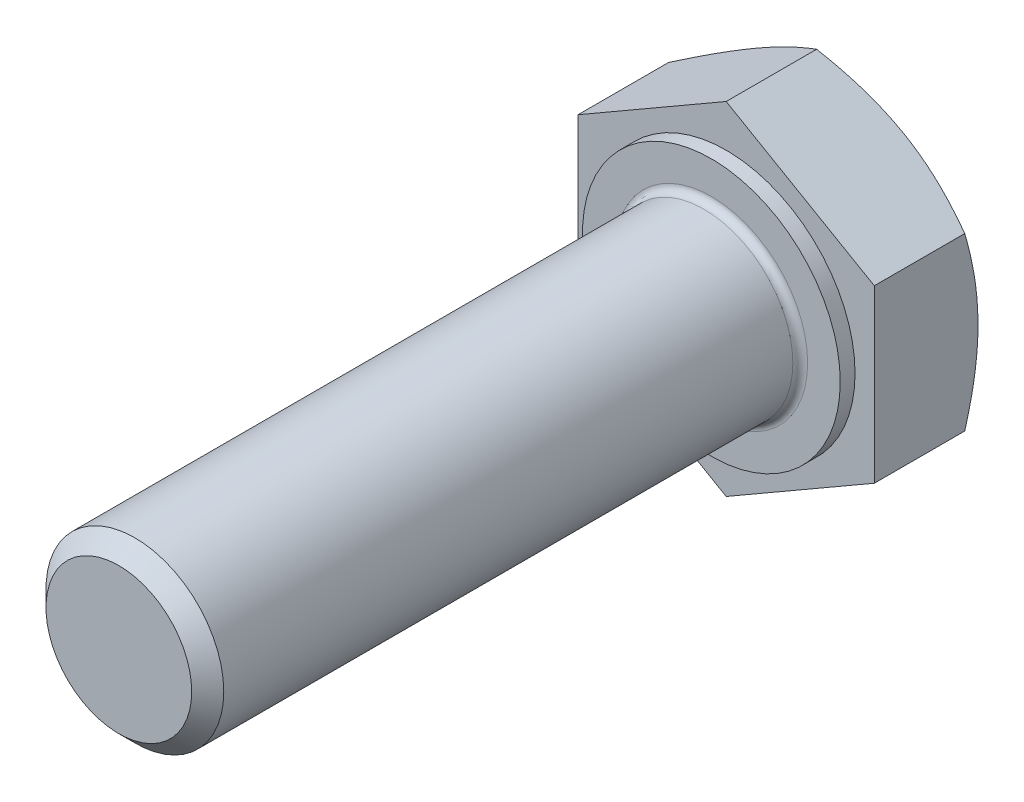
ISO-10303-21;
HEADER;
FILE_DESCRIPTION(('STEP AP214'),'2;1');
FILE_NAME('part.step','',(''),(''),'','','');
FILE_SCHEMA(('AUTOMOTIVE_DESIGN { 1 0 10303 214 1 1 1 1 }'));
ENDSEC;
DATA;
#1=APPLICATION_CONTEXT('core data for automotive mechanical design processes');
#2=APPLICATION_PROTOCOL_DEFINITION('international standard','automotive_design',2000,#1);
#3=PRODUCT_CONTEXT('',#1,'mechanical');
#4=PRODUCT('Part','Part','',(#3));
#5=PRODUCT_RELATED_PRODUCT_CATEGORY('part','',(#4));
#6=PRODUCT_DEFINITION_FORMATION('','',#4);
#7=PRODUCT_DEFINITION_CONTEXT('part definition',#1,'design');
#8=PRODUCT_DEFINITION('design','',#6,#7);
#9=PRODUCT_DEFINITION_SHAPE('','',#8);
#10=(LENGTH_UNIT() NAMED_UNIT(*) SI_UNIT(.MILLI.,.METRE.));
#11=(NAMED_UNIT(*) PLANE_ANGLE_UNIT() SI_UNIT($,.RADIAN.));
#12=(NAMED_UNIT(*) SI_UNIT($,.STERADIAN.) SOLID_ANGLE_UNIT());
#13=UNCERTAINTY_MEASURE_WITH_UNIT(LENGTH_MEASURE(1.E-05),#10,'distance_accuracy_value','');
#14=(GEOMETRIC_REPRESENTATION_CONTEXT(3) GLOBAL_UNCERTAINTY_ASSIGNED_CONTEXT((#13)) GLOBAL_UNIT_ASSIGNED_CONTEXT((#10,
#11,#12)) REPRESENTATION_CONTEXT('',''));
#15=CARTESIAN_POINT('',(0.,0.,0.));
#16=DIRECTION('',(0.,0.,1.));
#17=DIRECTION('',(1.,0.,0.));
#18=AXIS2_PLACEMENT_3D('',#15,#16,#17);
#19=CARTESIAN_POINT('',(0.,0.,-0.5));
#20=DIRECTION('',(0.,0.,1.));
#21=DIRECTION('',(-1.,0.,0.));
#22=AXIS2_PLACEMENT_3D('',#19,#20,#21);
#23=PLANE('',#22);
#24=CARTESIAN_POINT('',(0.,0.,-0.5));
#25=DIRECTION('',(0.,0.,1.));
#26=DIRECTION('',(1.,0.,0.));
#27=AXIS2_PLACEMENT_3D('',#24,#25,#26);
#28=CIRCLE('',#27,4.35);
#29=CARTESIAN_POINT('',(4.35,0.,-0.5));
#30=VERTEX_POINT('',#29);
#31=EDGE_CURVE('E12',#30,#30,#28,.T.);
#32=ORIENTED_EDGE('',*,*,#31,.F.);
#33=EDGE_LOOP('',(#32));
#34=FACE_BOUND('',#33,.T.);
#35=DIRECTION('',(0.866025403784439,-0.5,0.));
#36=VECTOR('',#35,1.);
#37=CARTESIAN_POINT('',(0.,-5.77350269189626,-0.5));
#38=LINE('',#37,#36);
#39=CARTESIAN_POINT('',(-5.,-2.88675134594813,-0.5));
#40=VERTEX_POINT('',#39);
#41=CARTESIAN_POINT('',(0.,-5.77350269189626,-0.5));
#42=VERTEX_POINT('',#41);
#43=EDGE_CURVE('E234',#40,#42,#38,.T.);
#44=ORIENTED_EDGE('',*,*,#43,.T.);
#45=DIRECTION('',(0.866025403784439,0.5,0.));
#46=VECTOR('',#45,1.);
#47=CARTESIAN_POINT('',(5.,-2.88675134594812,-0.5));
#48=LINE('',#47,#46);
#49=CARTESIAN_POINT('',(5.,-2.88675134594812,-0.5));
#50=VERTEX_POINT('',#49);
#51=EDGE_CURVE('E122',#42,#50,#48,.T.);
#52=ORIENTED_EDGE('',*,*,#51,.T.);
#53=DIRECTION('',(0.,1.,0.));
#54=VECTOR('',#53,1.);
#55=CARTESIAN_POINT('',(5.,2.88675134594813,-0.5));
#56=LINE('',#55,#54);
#57=CARTESIAN_POINT('',(5.,2.88675134594813,-0.5));
#58=VERTEX_POINT('',#57);
#59=EDGE_CURVE('E48',#50,#58,#56,.T.);
#60=ORIENTED_EDGE('',*,*,#59,.T.);
#61=DIRECTION('',(-0.866025403784439,0.5,0.));
#62=VECTOR('',#61,1.);
#63=CARTESIAN_POINT('',(0.,5.77350269189626,-0.5));
#64=LINE('',#63,#62);
#65=CARTESIAN_POINT('',(0.,5.77350269189626,-0.5));
#66=VERTEX_POINT('',#65);
#67=EDGE_CURVE('E129',#58,#66,#64,.T.);
#68=ORIENTED_EDGE('',*,*,#67,.T.);
#69=DIRECTION('',(-0.866025403784439,-0.5,0.));
#70=VECTOR('',#69,1.);
#71=CARTESIAN_POINT('',(-5.,2.88675134594813,-0.5));
#72=LINE('',#71,#70);
#73=CARTESIAN_POINT('',(-5.,2.88675134594813,-0.5));
#74=VERTEX_POINT('',#73);
#75=EDGE_CURVE('E245',#66,#74,#72,.T.);
#76=ORIENTED_EDGE('',*,*,#75,.T.);
#77=DIRECTION('',(0.,-1.,0.));
#78=VECTOR('',#77,1.);
#79=CARTESIAN_POINT('',(-5.,-2.88675134594813,-0.5));
#80=LINE('',#79,#78);
#81=EDGE_CURVE('E236',#74,#40,#80,.T.);
#82=ORIENTED_EDGE('',*,*,#81,.T.);
#83=EDGE_LOOP('',(#44,#52,#60,#68,#76,#82));
#84=FACE_BOUND('',#83,.T.);
#85=ADVANCED_FACE('F39',(#34,#84),#23,.T.);
#86=CARTESIAN_POINT('',(0.,0.,-3.55255354137804));
#87=DIRECTION('',(0.,0.,1.));
#88=DIRECTION('',(-1.,0.,0.));
#89=AXIS2_PLACEMENT_3D('',#86,#87,#88);
#90=CONICAL_SURFACE('',#89,5.775,1.0471975511966);
#91=CARTESIAN_POINT('',(0.,0.,-4.));
#92=DIRECTION('',(0.,0.,1.));
#93=DIRECTION('',(-1.,0.,0.));
#94=AXIS2_PLACEMENT_3D('',#91,#92,#93);
#95=CIRCLE('',#94,5.);
#96=CARTESIAN_POINT('',(-2.5,-4.3301270189222,-4.));
#97=VERTEX_POINT('',#96);
#98=CARTESIAN_POINT('',(2.5,-4.33012701892219,-4.));
#99=VERTEX_POINT('',#98);
#100=EDGE_CURVE('E298',#97,#99,#95,.T.);
#101=ORIENTED_EDGE('',*,*,#100,.T.);
#102=CARTESIAN_POINT('',(5.000002,-2.88675019124759,-3.55341734594793));
#103=CARTESIAN_POINT('',(4.78027074694607,-3.01361208934764,-3.62667401283849));
#104=CARTESIAN_POINT('',(4.5586601198803,-3.14155904453935,-3.69330350087609));
#105=CARTESIAN_POINT('',(4.11160176522467,-3.39966830594325,-3.80960388176341));
#106=CARTESIAN_POINT('',(3.88614609670003,-3.52983519685628,-3.859233638035));
#107=CARTESIAN_POINT('',(3.43799439633442,-3.78857570170015,-3.93647343389728));
#108=CARTESIAN_POINT('',(3.21536814331772,-3.91710902880802,-3.96459799992946));
#109=CARTESIAN_POINT('',(2.8806459561398,-4.11036097367893,-3.98981464288414));
#110=CARTESIAN_POINT('',(2.76899557601673,-4.17482235069811,-3.99539321968897));
#111=CARTESIAN_POINT('',(2.54559174139457,-4.30380461475521,-4.00079886451652));
#112=CARTESIAN_POINT('',(2.43383829018766,-4.36832549989239,-4.00062611028573));
#113=CARTESIAN_POINT('',(2.12769088590962,-4.54507978616402,-3.99223835401767));
#114=CARTESIAN_POINT('',(1.93339845483021,-4.65725457354923,-3.97816111429647));
#115=CARTESIAN_POINT('',(1.54610304420474,-4.88085968312974,-3.93352860367383));
#116=CARTESIAN_POINT('',(1.35310142524446,-4.9922892197905,-3.90295808665975));
#117=CARTESIAN_POINT('',(0.965026180739004,-5.21634456667155,-3.826542206783));
#118=CARTESIAN_POINT('',(0.770001514907567,-5.32894210998795,-3.78037315312653));
#119=CARTESIAN_POINT('',(0.382860131316658,-5.55245829201861,-3.67558875648398));
#120=CARTESIAN_POINT('',(0.190738457644299,-5.66337979203051,-3.61699801824105));
#121=CARTESIAN_POINT('',(-1.9999999987924E-06,-5.7735038465968,-3.55341734594793));
#122=B_SPLINE_CURVE_WITH_KNOTS('',3,(#102,#103,#104,#105,#106,#107,#108,#109,#110,#111,#112,
#113,#114,#115,#116,#117,#118,#119,#120,#121),.UNSPECIFIED.,.F.,.F.,(4,2,2,2,2,2,2,2,2,4),(0.,
0.792540187012439,1.58698486313849,2.36176947896395,2.74878786986339,3.13579429986343,
3.80946255620209,4.48375460996337,5.17299926182492,5.86089121185928),.UNSPECIFIED.);
#123=CARTESIAN_POINT('',(0.,-5.77350269189626,-3.5534180126148));
#124=VERTEX_POINT('',#123);
#125=EDGE_CURVE('E55',#99,#124,#122,.T.);
#126=ORIENTED_EDGE('',*,*,#125,.T.);
#127=CARTESIAN_POINT('',(2.00000000060511E-06,-5.7735038465968,-3.55341734594793));
#128=CARTESIAN_POINT('',(-0.219729253053924,-5.64664194849674,-3.62667401283849));
#129=CARTESIAN_POINT('',(-0.441339880119702,-5.51869499330503,-3.69330350087609));
#130=CARTESIAN_POINT('',(-0.888398234775334,-5.26058573190113,-3.80960388176341));
#131=CARTESIAN_POINT('',(-1.11385390329997,-5.13041884098811,-3.85923363803499));
#132=CARTESIAN_POINT('',(-1.56200560366558,-4.87167833614423,-3.93647343389728));
#133=CARTESIAN_POINT('',(-1.78463185668228,-4.74314500903636,-3.96459799992946));
#134=CARTESIAN_POINT('',(-2.1193540438602,-4.54989306416545,-3.98981464288413));
#135=CARTESIAN_POINT('',(-2.23100442398327,-4.48543168714627,-3.99539321968897));
#136=CARTESIAN_POINT('',(-2.45440825860543,-4.35644942308917,-4.00079886451652));
#137=CARTESIAN_POINT('',(-2.56616170981234,-4.291928537952,-4.00062611028572));
#138=CARTESIAN_POINT('',(-2.87230911409038,-4.11517425168036,-3.99223835401768));
#139=CARTESIAN_POINT('',(-3.06660154516979,-4.00299946429516,-3.97816111429647));
#140=CARTESIAN_POINT('',(-3.45389695579525,-3.77939435471464,-3.93352860367382));
#141=CARTESIAN_POINT('',(-3.64689857475554,-3.66796481805389,-3.90295808665975));
#142=CARTESIAN_POINT('',(-4.03497381926099,-3.44390947117283,-3.826542206783));
#143=CARTESIAN_POINT('',(-4.22999848509243,-3.33131192785644,-3.78037315312652));
#144=CARTESIAN_POINT('',(-4.61713986868334,-3.10779574582578,-3.67558875648398));
#145=CARTESIAN_POINT('',(-4.8092615423557,-2.99687424581388,-3.61699801824105));
#146=CARTESIAN_POINT('',(-5.000002,-2.88675019124759,-3.55341734594793));
#147=B_SPLINE_CURVE_WITH_KNOTS('',3,(#127,#128,#129,#130,#131,#132,#133,#134,#135,#136,#137,
#138,#139,#140,#141,#142,#143,#144,#145,#146),.UNSPECIFIED.,.F.,.F.,(4,2,2,2,2,2,2,2,2,4),(0.,
0.792540187012439,1.58698486313849,2.36176947896395,2.74878786986339,3.13579429986343,
3.80946255620209,4.48375460996337,5.17299926182491,5.86089121185927),.UNSPECIFIED.);
#148=EDGE_CURVE('E194',#124,#97,#147,.T.);
#149=ORIENTED_EDGE('',*,*,#148,.T.);
#150=EDGE_LOOP('',(#101,#126,#149));
#151=FACE_BOUND('',#150,.T.);
#152=ADVANCED_FACE('F160',(#151),#90,.T.);
#153=CARTESIAN_POINT('',(5.,0.,-4.));
#154=VERTEX_POINT('',#153);
#155=CARTESIAN_POINT('',(2.5,4.3301270189222,-4.));
#156=VERTEX_POINT('',#155);
#157=EDGE_CURVE('E318',#154,#156,#95,.T.);
#158=ORIENTED_EDGE('',*,*,#157,.T.);
#159=CARTESIAN_POINT('',(-2.00000000180708E-06,5.7735038465968,-3.55341734594793));
#160=CARTESIAN_POINT('',(0.219729253053923,5.64664194849674,-3.62667401283849));
#161=CARTESIAN_POINT('',(0.441339880119701,5.51869499330503,-3.69330350087608));
#162=CARTESIAN_POINT('',(0.888398234775333,5.26058573190113,-3.80960388176341));
#163=CARTESIAN_POINT('',(1.11385390329997,5.13041884098811,-3.85923363803499));
#164=CARTESIAN_POINT('',(1.56200560366558,4.87167833614423,-3.93647343389727));
#165=CARTESIAN_POINT('',(1.78463185668228,4.74314500903636,-3.96459799992946));
#166=CARTESIAN_POINT('',(2.1193540438602,4.54989306416545,-3.98981464288413));
#167=CARTESIAN_POINT('',(2.23100442398327,4.48543168714627,-3.99539321968896));
#168=CARTESIAN_POINT('',(2.45440825860543,4.35644942308917,-4.00079886451652));
#169=CARTESIAN_POINT('',(2.56616170981234,4.291928537952,-4.00062611028572));
#170=CARTESIAN_POINT('',(2.87230911409038,4.11517425168036,-3.99223835401768));
#171=CARTESIAN_POINT('',(3.06660154516979,4.00299946429516,-3.97816111429647));
#172=CARTESIAN_POINT('',(3.45389695579525,3.77939435471464,-3.93352860367382));
#173=CARTESIAN_POINT('',(3.64689857475554,3.66796481805389,-3.90295808665975));
#174=CARTESIAN_POINT('',(4.03497381926099,3.44390947117283,-3.826542206783));
#175=CARTESIAN_POINT('',(4.22999848509243,3.33131192785644,-3.78037315312652));
#176=CARTESIAN_POINT('',(4.61713986868334,3.10779574582578,-3.67558875648398));
#177=CARTESIAN_POINT('',(4.8092615423557,2.99687424581388,-3.61699801824105));
#178=CARTESIAN_POINT('',(5.000002,2.88675019124759,-3.55341734594793));
#179=B_SPLINE_CURVE_WITH_KNOTS('',3,(#159,#160,#161,#162,#163,#164,#165,#166,#167,#168,#169,
#170,#171,#172,#173,#174,#175,#176,#177,#178),.UNSPECIFIED.,.F.,.F.,(4,2,2,2,2,2,2,2,2,4),(0.,
0.792540187012439,1.58698486313849,2.36176947896395,2.74878786986339,3.13579429986343,
3.80946255620209,4.48375460996337,5.17299926182492,5.86089121185927),.UNSPECIFIED.);
#180=CARTESIAN_POINT('',(5.,2.88675134594813,-3.5534180126148));
#181=VERTEX_POINT('',#180);
#182=EDGE_CURVE('E168',#156,#181,#179,.T.);
#183=ORIENTED_EDGE('',*,*,#182,.T.);
#184=CARTESIAN_POINT('',(5.,7.6562098916072,-1.60730851220314));
#185=CARTESIAN_POINT('',(5.,7.43668068445188,-1.71339764971142));
#186=CARTESIAN_POINT('',(5.,7.21663244981121,-1.81843220971194));
#187=CARTESIAN_POINT('',(5.,6.77521729214901,-2.02578955660455));
#188=CARTESIAN_POINT('',(5.,6.55385014884433,-2.12811187401153));
#189=CARTESIAN_POINT('',(5.,6.10832079221155,-2.32998113103873));
#190=CARTESIAN_POINT('',(5.,5.8841498332562,-2.42950883856025));
#191=CARTESIAN_POINT('',(5.,5.43396545890423,-2.62428946678928));
#192=CARTESIAN_POINT('',(5.,5.20795214026935,-2.71954261031161));
#193=CARTESIAN_POINT('',(5.,4.75091730358843,-2.90576853562678));
#194=CARTESIAN_POINT('',(5.,4.51986836696229,-2.99667439468201));
#195=CARTESIAN_POINT('',(5.,4.05504511794165,-3.17136663535019));
#196=CARTESIAN_POINT('',(5.,3.82127050561655,-3.25515222488515));
#197=CARTESIAN_POINT('',(5.,3.3511049214154,-3.41335295122633));
#198=CARTESIAN_POINT('',(5.,3.1147207202618,-3.48778800852407));
#199=CARTESIAN_POINT('',(5.,2.63858935414024,-3.62486947210752));
#200=CARTESIAN_POINT('',(5.,2.39884327849118,-3.6875196062624));
#201=CARTESIAN_POINT('',(5.,1.91583600979795,-3.79799301517174));
#202=CARTESIAN_POINT('',(5.,1.67257390027251,-3.845812348464));
#203=CARTESIAN_POINT('',(5.,1.18308256945893,-3.92339260894802));
#204=CARTESIAN_POINT('',(5.,0.936853345569403,-3.95315352030607));
#205=CARTESIAN_POINT('',(5.,0.567117593289453,-3.98234325133118));
#206=CARTESIAN_POINT('',(5.,0.444189898759257,-3.98949936634909));
#207=CARTESIAN_POINT('',(5.,0.198136128994923,-3.99860265589306));
#208=CARTESIAN_POINT('',(5.,0.0750100563582899,-4.00054989807679));
#209=CARTESIAN_POINT('',(5.,-0.171177216207564,-3.99918313774808));
#210=CARTESIAN_POINT('',(5.,-0.294238424644018,-3.99587061329656));
#211=CARTESIAN_POINT('',(5.,-0.540114422491308,-3.98406827403109));
#212=CARTESIAN_POINT('',(5.,-0.662929199152967,-3.97557819794883));
#213=CARTESIAN_POINT('',(5.,-0.960602635172514,-3.94890221291608));
#214=CARTESIAN_POINT('',(5.,-1.13523252606317,-3.92812146624754));
#215=CARTESIAN_POINT('',(5.,-1.48312982453558,-3.87724859224778));
#216=CARTESIAN_POINT('',(5.,-1.65639704728773,-3.84715522336811));
#217=CARTESIAN_POINT('',(5.,-2.00145990992849,-3.77872143768562));
#218=CARTESIAN_POINT('',(5.,-2.17325390132185,-3.74037278751756));
#219=CARTESIAN_POINT('',(5.,-2.51508012917843,-3.65659803659306));
#220=CARTESIAN_POINT('',(5.,-2.68511247222647,-3.61117236671524));
#221=CARTESIAN_POINT('',(5.,-3.02759472997325,-3.51314465542335));
#222=CARTESIAN_POINT('',(5.,-3.20000183568427,-3.46039407843568));
#223=CARTESIAN_POINT('',(5.,-3.54299370259062,-3.34968060702553));
#224=CARTESIAN_POINT('',(5.,-3.71357963115188,-3.29172130765132));
#225=CARTESIAN_POINT('',(5.,-4.0522446464634,-3.17178761900049));
#226=CARTESIAN_POINT('',(5.00000000000001,-4.22033243885281,-3.10983766516145));
#227=CARTESIAN_POINT('',(5.00000000000001,-4.55520387372807,-2.98230148307792));
#228=CARTESIAN_POINT('',(5.,-4.72198695763951,-2.91671378527652));
#229=CARTESIAN_POINT('',(5.,-4.88816412582648,-2.84966706307693));
#230=B_SPLINE_CURVE_WITH_KNOTS('',3,(#184,#185,#186,#187,#188,#189,#190,#191,#192,#193,#194,
#195,#196,#197,#198,#199,#200,#201,#202,#203,#204,#205,#206,#207,#208,#209,#210,#211,#212,#213,
#214,#215,#216,#217,#218,#219,#220,#221,#222,#223,#224,#225,#226,#227,#228,#229),.UNSPECIFIED.,
.F.,.F.,(4,2,2,2,2,2,2,2,2,2,2,2,2,2,2,2,2,2,2,2,2,2,4),(0.,0.731468501053906,1.46306280212576,
2.19884351250474,2.9345858251137,3.67936259473396,4.42422210717282,5.16746683356836,
5.91047605604179,6.65368257320434,7.39688974201329,7.76620341787991,8.13551229673491,
8.5047174134909,8.87394116252395,9.40123334160666,9.92859584900567,10.456486776027,
10.9843455753877,11.5251349139371,12.0655538262241,12.6029309498223,13.1405267642076),.UNSPECIFIED.);
#231=EDGE_CURVE('E134',#181,#154,#230,.T.);
#232=ORIENTED_EDGE('',*,*,#231,.T.);
#233=EDGE_LOOP('',(#158,#183,#232));
#234=FACE_BOUND('',#233,.T.);
#235=ADVANCED_FACE('F161',(#234),#90,.T.);
#236=CARTESIAN_POINT('',(-2.5,4.3301270189222,-4.));
#237=VERTEX_POINT('',#236);
#238=EDGE_CURVE('E309',#156,#237,#95,.T.);
#239=ORIENTED_EDGE('',*,*,#238,.T.);
#240=CARTESIAN_POINT('',(-5.000002,2.88675019124759,-3.55341734594793));
#241=CARTESIAN_POINT('',(-4.78027074694607,3.01361208934765,-3.62667401283849));
#242=CARTESIAN_POINT('',(-4.5586601198803,3.14155904453936,-3.69330350087609));
#243=CARTESIAN_POINT('',(-4.11160176522467,3.39966830594326,-3.80960388176341));
#244=CARTESIAN_POINT('',(-3.88614609670003,3.52983519685628,-3.859233638035));
#245=CARTESIAN_POINT('',(-3.43799439633442,3.78857570170016,-3.93647343389728));
#246=CARTESIAN_POINT('',(-3.21536814331772,3.91710902880803,-3.96459799992946));
#247=CARTESIAN_POINT('',(-2.8806459561398,4.11036097367894,-3.98981464288413));
#248=CARTESIAN_POINT('',(-2.76899557601673,4.17482235069812,-3.99539321968897));
#249=CARTESIAN_POINT('',(-2.54559174139457,4.30380461475522,-4.00079886451652));
#250=CARTESIAN_POINT('',(-2.43383829018766,4.36832549989239,-4.00062611028572));
#251=CARTESIAN_POINT('',(-2.12769088590962,4.54507978616403,-3.99223835401768));
#252=CARTESIAN_POINT('',(-1.93339845483021,4.65725457354923,-3.97816111429647));
#253=CARTESIAN_POINT('',(-1.54610304420475,4.88085968312975,-3.93352860367382));
#254=CARTESIAN_POINT('',(-1.35310142524446,4.9922892197905,-3.90295808665975));
#255=CARTESIAN_POINT('',(-0.965026180739007,5.21634456667156,-3.826542206783));
#256=CARTESIAN_POINT('',(-0.77000151490757,5.32894210998795,-3.78037315312652));
#257=CARTESIAN_POINT('',(-0.38286013131666,5.55245829201861,-3.67558875648398));
#258=CARTESIAN_POINT('',(-0.190738457644301,5.66337979203051,-3.61699801824105));
#259=CARTESIAN_POINT('',(1.99999999767444E-06,5.7735038465968,-3.55341734594793));
#260=B_SPLINE_CURVE_WITH_KNOTS('',3,(#240,#241,#242,#243,#244,#245,#246,#247,#248,#249,#250,
#251,#252,#253,#254,#255,#256,#257,#258,#259),.UNSPECIFIED.,.F.,.F.,(4,2,2,2,2,2,2,2,2,4),(0.,
0.792540187012439,1.58698486313849,2.36176947896395,2.74878786986339,3.13579429986343,
3.80946255620209,4.48375460996337,5.17299926182492,5.86089121185927),.UNSPECIFIED.);
#261=CARTESIAN_POINT('',(0.,5.77350269189626,-3.5534180126148));
#262=VERTEX_POINT('',#261);
#263=EDGE_CURVE('E176',#237,#262,#260,.T.);
#264=ORIENTED_EDGE('',*,*,#263,.T.);
#265=EDGE_CURVE('E276',#262,#156,#179,.T.);
#266=ORIENTED_EDGE('',*,*,#265,.T.);
#267=EDGE_LOOP('',(#239,#264,#266));
#268=FACE_BOUND('',#267,.T.);
#269=ADVANCED_FACE('F436',(#268),#90,.T.);
#270=CARTESIAN_POINT('',(-5.,0.,-4.));
#271=VERTEX_POINT('',#270);
#272=EDGE_CURVE('E299',#237,#271,#95,.T.);
#273=ORIENTED_EDGE('',*,*,#272,.T.);
#274=CARTESIAN_POINT('',(-5.,7.6562098916072,-1.60730851220314));
#275=CARTESIAN_POINT('',(-5.,7.43668068445187,-1.71339764971142));
#276=CARTESIAN_POINT('',(-5.00000000000001,7.21663244981121,-1.81843220971194));
#277=CARTESIAN_POINT('',(-5.00000000000001,6.77521729214901,-2.02578955660455));
#278=CARTESIAN_POINT('',(-5.,6.55385014884433,-2.12811187401152));
#279=CARTESIAN_POINT('',(-5.,6.10832079221155,-2.32998113103873));
#280=CARTESIAN_POINT('',(-5.,5.8841498332562,-2.42950883856025));
#281=CARTESIAN_POINT('',(-5.,5.43396545890423,-2.62428946678928));
#282=CARTESIAN_POINT('',(-5.,5.20795214026935,-2.71954261031161));
#283=CARTESIAN_POINT('',(-5.,4.75091730358843,-2.90576853562678));
#284=CARTESIAN_POINT('',(-5.,4.51986836696229,-2.99667439468201));
#285=CARTESIAN_POINT('',(-5.,4.05504511794165,-3.17136663535019));
#286=CARTESIAN_POINT('',(-5.,3.82127050561654,-3.25515222488515));
#287=CARTESIAN_POINT('',(-5.,3.3511049214154,-3.41335295122633));
#288=CARTESIAN_POINT('',(-5.,3.1147207202618,-3.48778800852407));
#289=CARTESIAN_POINT('',(-5.,2.63858935414023,-3.62486947210752));
#290=CARTESIAN_POINT('',(-5.,2.39884327849117,-3.6875196062624));
#291=CARTESIAN_POINT('',(-5.,1.91583600979795,-3.79799301517174));
#292=CARTESIAN_POINT('',(-5.,1.67257390027251,-3.845812348464));
#293=CARTESIAN_POINT('',(-5.,1.18308256945893,-3.92339260894803));
#294=CARTESIAN_POINT('',(-5.,0.936853345569398,-3.95315352030607));
#295=CARTESIAN_POINT('',(-5.,0.567117593289449,-3.98234325133118));
#296=CARTESIAN_POINT('',(-5.,0.444189898759253,-3.98949936634909));
#297=CARTESIAN_POINT('',(-5.,0.19813612899492,-3.99860265589306));
#298=CARTESIAN_POINT('',(-5.,0.0750100563582872,-4.00054989807679));
#299=CARTESIAN_POINT('',(-5.,-0.171177216207567,-3.99918313774808));
#300=CARTESIAN_POINT('',(-5.,-0.294238424644022,-3.99587061329656));
#301=CARTESIAN_POINT('',(-5.,-0.540114422491312,-3.98406827403109));
#302=CARTESIAN_POINT('',(-5.,-0.66292919915297,-3.97557819794883));
#303=CARTESIAN_POINT('',(-5.,-0.960602635172518,-3.94890221291608));
#304=CARTESIAN_POINT('',(-5.,-1.13523252606317,-3.92812146624754));
#305=CARTESIAN_POINT('',(-5.,-1.48312982453558,-3.87724859224778));
#306=CARTESIAN_POINT('',(-5.,-1.65639704728773,-3.84715522336811));
#307=CARTESIAN_POINT('',(-5.,-2.0014599099285,-3.77872143768563));
#308=CARTESIAN_POINT('',(-5.,-2.17325390132186,-3.74037278751756));
#309=CARTESIAN_POINT('',(-5.,-2.51508012917844,-3.65659803659306));
#310=CARTESIAN_POINT('',(-5.,-2.68511247222647,-3.61117236671524));
#311=CARTESIAN_POINT('',(-5.,-3.02759472997325,-3.51314465542335));
#312=CARTESIAN_POINT('',(-5.,-3.20000183568427,-3.46039407843569));
#313=CARTESIAN_POINT('',(-5.,-3.54299370259062,-3.34968060702553));
#314=CARTESIAN_POINT('',(-5.,-3.71357963115188,-3.29172130765132));
#315=CARTESIAN_POINT('',(-5.,-4.0522446464634,-3.1717876190005));
#316=CARTESIAN_POINT('',(-5.,-4.22033243885281,-3.10983766516145));
#317=CARTESIAN_POINT('',(-5.,-4.55520387372807,-2.98230148307792));
#318=CARTESIAN_POINT('',(-5.,-4.72198695763952,-2.91671378527652));
#319=CARTESIAN_POINT('',(-5.,-4.88816412582648,-2.84966706307693));
#320=B_SPLINE_CURVE_WITH_KNOTS('',3,(#274,#275,#276,#277,#278,#279,#280,#281,#282,#283,#284,
#285,#286,#287,#288,#289,#290,#291,#292,#293,#294,#295,#296,#297,#298,#299,#300,#301,#302,#303,
#304,#305,#306,#307,#308,#309,#310,#311,#312,#313,#314,#315,#316,#317,#318,#319),.UNSPECIFIED.,
.F.,.F.,(4,2,2,2,2,2,2,2,2,2,2,2,2,2,2,2,2,2,2,2,2,2,4),(0.,0.731468501053906,1.46306280212576,
2.19884351250474,2.9345858251137,3.67936259473396,4.42422210717282,5.16746683356837,
5.9104760560418,6.65368257320435,7.39688974201329,7.76620341787992,8.13551229673491,
8.5047174134909,8.87394116252395,9.40123334160667,9.92859584900567,10.456486776027,
10.9843455753877,11.5251349139371,12.0655538262241,12.6029309498223,13.1405267642076),.UNSPECIFIED.);
#321=CARTESIAN_POINT('',(-5.,2.88675134594813,-3.5534180126148));
#322=VERTEX_POINT('',#321);
#323=EDGE_CURVE('E183',#271,#322,#320,.F.);
#324=ORIENTED_EDGE('',*,*,#323,.T.);
#325=EDGE_CURVE('E605',#322,#237,#260,.T.);
#326=ORIENTED_EDGE('',*,*,#325,.T.);
#327=EDGE_LOOP('',(#273,#324,#326));
#328=FACE_BOUND('',#327,.T.);
#329=ADVANCED_FACE('F426',(#328),#90,.T.);
#330=EDGE_CURVE('E293',#271,#97,#95,.T.);
#331=ORIENTED_EDGE('',*,*,#330,.T.);
#332=CARTESIAN_POINT('',(-5.,-2.88675134594813,-3.5534180126148));
#333=VERTEX_POINT('',#332);
#334=EDGE_CURVE('E63',#97,#333,#147,.T.);
#335=ORIENTED_EDGE('',*,*,#334,.T.);
#336=EDGE_CURVE('E195',#333,#271,#320,.F.);
#337=ORIENTED_EDGE('',*,*,#336,.T.);
#338=EDGE_LOOP('',(#331,#335,#337));
#339=FACE_BOUND('',#338,.T.);
#340=ADVANCED_FACE('F229',(#339),#90,.T.);
#341=CARTESIAN_POINT('',(0.,-5.,-4.));
#342=DIRECTION('',(0.,0.,-1.));
#343=DIRECTION('',(1.,0.,0.));
#344=AXIS2_PLACEMENT_3D('',#341,#342,#343);
#345=PLANE('',#344);
#346=ORIENTED_EDGE('',*,*,#330,.F.);
#347=ORIENTED_EDGE('',*,*,#272,.F.);
#348=ORIENTED_EDGE('',*,*,#238,.F.);
#349=ORIENTED_EDGE('',*,*,#157,.F.);
#350=EDGE_CURVE('E132',#99,#154,#95,.T.);
#351=ORIENTED_EDGE('',*,*,#350,.F.);
#352=ORIENTED_EDGE('',*,*,#100,.F.);
#353=EDGE_LOOP('',(#346,#347,#348,#349,#351,#352));
#354=FACE_BOUND('',#353,.T.);
#355=ADVANCED_FACE('F159',(#354),#345,.T.);
#356=CARTESIAN_POINT('',(5.,-2.88675134594812,-3.5534180126148));
#357=VERTEX_POINT('',#356);
#358=EDGE_CURVE('E116',#154,#357,#230,.T.);
#359=ORIENTED_EDGE('',*,*,#358,.T.);
#360=EDGE_CURVE('E124',#357,#99,#122,.T.);
#361=ORIENTED_EDGE('',*,*,#360,.T.);
#362=ORIENTED_EDGE('',*,*,#350,.T.);
#363=EDGE_LOOP('',(#359,#361,#362));
#364=FACE_BOUND('',#363,.T.);
#365=ADVANCED_FACE('F131',(#364),#90,.T.);
#366=CARTESIAN_POINT('',(5.,-2.88675134594812,-5.));
#367=DIRECTION('',(-0.5,0.866025403784439,0.));
#368=DIRECTION('',(0.866025403784439,0.5,0.));
#369=AXIS2_PLACEMENT_3D('',#366,#367,#368);
#370=PLANE('',#369);
#371=ORIENTED_EDGE('',*,*,#51,.F.);
#372=DIRECTION('',(0.,0.,1.));
#373=VECTOR('',#372,1.);
#374=CARTESIAN_POINT('',(0.,-5.77350269189626,-5.));
#375=LINE('',#374,#373);
#376=EDGE_CURVE('E135',#124,#42,#375,.T.);
#377=ORIENTED_EDGE('',*,*,#376,.F.);
#378=ORIENTED_EDGE('',*,*,#125,.F.);
#379=ORIENTED_EDGE('',*,*,#360,.F.);
#380=DIRECTION('',(0.,0.,1.));
#381=VECTOR('',#380,1.);
#382=CARTESIAN_POINT('',(5.,-2.88675134594812,-5.));
#383=LINE('',#382,#381);
#384=EDGE_CURVE('E113',#357,#50,#383,.T.);
#385=ORIENTED_EDGE('',*,*,#384,.T.);
#386=EDGE_LOOP('',(#371,#377,#378,#379,#385));
#387=FACE_BOUND('',#386,.T.);
#388=ADVANCED_FACE('F41',(#387),#370,.F.);
#389=CARTESIAN_POINT('',(0.,-5.77350269189626,-5.));
#390=DIRECTION('',(0.5,0.866025403784439,0.));
#391=DIRECTION('',(0.866025403784439,-0.5,0.));
#392=AXIS2_PLACEMENT_3D('',#389,#390,#391);
#393=PLANE('',#392);
#394=ORIENTED_EDGE('',*,*,#43,.F.);
#395=DIRECTION('',(0.,0.,1.));
#396=VECTOR('',#395,1.);
#397=CARTESIAN_POINT('',(-5.,-2.88675134594813,-5.));
#398=LINE('',#397,#396);
#399=EDGE_CURVE('E141',#333,#40,#398,.T.);
#400=ORIENTED_EDGE('',*,*,#399,.F.);
#401=ORIENTED_EDGE('',*,*,#334,.F.);
#402=ORIENTED_EDGE('',*,*,#148,.F.);
#403=ORIENTED_EDGE('',*,*,#376,.T.);
#404=EDGE_LOOP('',(#394,#400,#401,#402,#403));
#405=FACE_BOUND('',#404,.T.);
#406=ADVANCED_FACE('F203',(#405),#393,.F.);
#407=CARTESIAN_POINT('',(-5.,-2.88675134594813,-5.));
#408=DIRECTION('',(1.,0.,0.));
#409=DIRECTION('',(0.,-1.,0.));
#410=AXIS2_PLACEMENT_3D('',#407,#408,#409);
#411=PLANE('',#410);
#412=ORIENTED_EDGE('',*,*,#81,.F.);
#413=DIRECTION('',(0.,0.,1.));
#414=VECTOR('',#413,1.);
#415=CARTESIAN_POINT('',(-5.,2.88675134594813,-5.));
#416=LINE('',#415,#414);
#417=EDGE_CURVE('E273',#322,#74,#416,.T.);
#418=ORIENTED_EDGE('',*,*,#417,.F.);
#419=ORIENTED_EDGE('',*,*,#323,.F.);
#420=ORIENTED_EDGE('',*,*,#336,.F.);
#421=ORIENTED_EDGE('',*,*,#399,.T.);
#422=EDGE_LOOP('',(#412,#418,#419,#420,#421));
#423=FACE_BOUND('',#422,.T.);
#424=ADVANCED_FACE('F206',(#423),#411,.F.);
#425=CARTESIAN_POINT('',(-5.,2.88675134594813,-5.));
#426=DIRECTION('',(0.5,-0.866025403784439,0.));
#427=DIRECTION('',(-0.866025403784439,-0.5,0.));
#428=AXIS2_PLACEMENT_3D('',#425,#426,#427);
#429=PLANE('',#428);
#430=ORIENTED_EDGE('',*,*,#75,.F.);
#431=DIRECTION('',(0.,0.,1.));
#432=VECTOR('',#431,1.);
#433=CARTESIAN_POINT('',(0.,5.77350269189626,-5.));
#434=LINE('',#433,#432);
#435=EDGE_CURVE('E270',#262,#66,#434,.T.);
#436=ORIENTED_EDGE('',*,*,#435,.F.);
#437=ORIENTED_EDGE('',*,*,#263,.F.);
#438=ORIENTED_EDGE('',*,*,#325,.F.);
#439=ORIENTED_EDGE('',*,*,#417,.T.);
#440=EDGE_LOOP('',(#430,#436,#437,#438,#439));
#441=FACE_BOUND('',#440,.T.);
#442=ADVANCED_FACE('F209',(#441),#429,.F.);
#443=CARTESIAN_POINT('',(0.,5.77350269189626,-5.));
#444=DIRECTION('',(-0.5,-0.866025403784439,0.));
#445=DIRECTION('',(-0.866025403784439,0.5,0.));
#446=AXIS2_PLACEMENT_3D('',#443,#444,#445);
#447=PLANE('',#446);
#448=ORIENTED_EDGE('',*,*,#67,.F.);
#449=DIRECTION('',(0.,0.,1.));
#450=VECTOR('',#449,1.);
#451=CARTESIAN_POINT('',(5.,2.88675134594813,-5.));
#452=LINE('',#451,#450);
#453=EDGE_CURVE('E121',#181,#58,#452,.T.);
#454=ORIENTED_EDGE('',*,*,#453,.F.);
#455=ORIENTED_EDGE('',*,*,#182,.F.);
#456=ORIENTED_EDGE('',*,*,#265,.F.);
#457=ORIENTED_EDGE('',*,*,#435,.T.);
#458=EDGE_LOOP('',(#448,#454,#455,#456,#457));
#459=FACE_BOUND('',#458,.T.);
#460=ADVANCED_FACE('F213',(#459),#447,.F.);
#461=CARTESIAN_POINT('',(5.,2.88675134594813,-5.));
#462=DIRECTION('',(-1.,0.,0.));
#463=DIRECTION('',(0.,1.,0.));
#464=AXIS2_PLACEMENT_3D('',#461,#462,#463);
#465=PLANE('',#464);
#466=ORIENTED_EDGE('',*,*,#59,.F.);
#467=ORIENTED_EDGE('',*,*,#384,.F.);
#468=ORIENTED_EDGE('',*,*,#358,.F.);
#469=ORIENTED_EDGE('',*,*,#231,.F.);
#470=ORIENTED_EDGE('',*,*,#453,.T.);
#471=EDGE_LOOP('',(#466,#467,#468,#469,#470));
#472=FACE_BOUND('',#471,.T.);
#473=ADVANCED_FACE('F114',(#472),#465,.F.);
#474=CARTESIAN_POINT('',(0.,0.,-0.5));
#475=DIRECTION('',(0.,0.,1.));
#476=DIRECTION('',(1.,0.,0.));
#477=AXIS2_PLACEMENT_3D('',#474,#475,#476);
#478=CYLINDRICAL_SURFACE('',#477,4.35);
#479=ORIENTED_EDGE('',*,*,#31,.T.);
#480=EDGE_LOOP('',(#479));
#481=FACE_BOUND('',#480,.T.);
#482=CARTESIAN_POINT('',(0.,0.,0.));
#483=DIRECTION('',(0.,0.,1.));
#484=DIRECTION('',(1.,0.,0.));
#485=AXIS2_PLACEMENT_3D('',#482,#483,#484);
#486=CIRCLE('',#485,4.35);
#487=CARTESIAN_POINT('',(4.35,0.,0.));
#488=VERTEX_POINT('',#487);
#489=EDGE_CURVE('E310',#488,#488,#486,.T.);
#490=ORIENTED_EDGE('',*,*,#489,.F.);
#491=EDGE_LOOP('',(#490));
#492=FACE_BOUND('',#491,.T.);
#493=ADVANCED_FACE('F221',(#481,#492),#478,.T.);
#494=CARTESIAN_POINT('',(3.25,0.,0.));
#495=DIRECTION('',(0.,0.,1.));
#496=DIRECTION('',(1.,0.,0.));
#497=AXIS2_PLACEMENT_3D('',#494,#495,#496);
#498=PLANE('',#497);
#499=ORIENTED_EDGE('',*,*,#489,.T.);
#500=EDGE_LOOP('',(#499));
#501=FACE_BOUND('',#500,.T.);
#502=CARTESIAN_POINT('',(0.,0.,0.));
#503=DIRECTION('',(0.,0.,1.));
#504=DIRECTION('',(1.,0.,0.));
#505=AXIS2_PLACEMENT_3D('',#502,#503,#504);
#506=CIRCLE('',#505,3.25);
#507=CARTESIAN_POINT('',(3.25,0.,0.));
#508=VERTEX_POINT('',#507);
#509=EDGE_CURVE('E320',#508,#508,#506,.T.);
#510=ORIENTED_EDGE('',*,*,#509,.F.);
#511=EDGE_LOOP('',(#510));
#512=FACE_BOUND('',#511,.T.);
#513=ADVANCED_FACE('F354',(#501,#512),#498,.T.);
#514=CARTESIAN_POINT('',(0.,0.,0.25));
#515=DIRECTION('',(0.,0.,1.));
#516=DIRECTION('',(1.,0.,0.));
#517=AXIS2_PLACEMENT_3D('',#514,#515,#516);
#518=TOROIDAL_SURFACE('',#517,3.25,0.25);
#519=ORIENTED_EDGE('',*,*,#509,.T.);
#520=EDGE_LOOP('',(#519));
#521=FACE_BOUND('',#520,.T.);
#522=CARTESIAN_POINT('',(0.,0.,0.25));
#523=DIRECTION('',(0.,0.,1.));
#524=DIRECTION('',(1.,0.,0.));
#525=AXIS2_PLACEMENT_3D('',#522,#523,#524);
#526=CIRCLE('',#525,3.);
#527=CARTESIAN_POINT('',(3.,0.,0.25));
#528=VERTEX_POINT('',#527);
#529=EDGE_CURVE('E324',#528,#528,#526,.T.);
#530=ORIENTED_EDGE('',*,*,#529,.F.);
#531=EDGE_LOOP('',(#530));
#532=FACE_BOUND('',#531,.T.);
#533=ADVANCED_FACE('F348',(#521,#532),#518,.F.);
#534=CARTESIAN_POINT('',(0.,0.,-0.5));
#535=DIRECTION('',(0.,0.,1.));
#536=DIRECTION('',(1.,0.,0.));
#537=AXIS2_PLACEMENT_3D('',#534,#535,#536);
#538=CYLINDRICAL_SURFACE('',#537,3.);
#539=ORIENTED_EDGE('',*,*,#529,.T.);
#540=EDGE_LOOP('',(#539));
#541=FACE_BOUND('',#540,.T.);
#542=CARTESIAN_POINT('',(0.,0.,19.45875));
#543=DIRECTION('',(0.,0.,1.));
#544=DIRECTION('',(1.,0.,0.));
#545=AXIS2_PLACEMENT_3D('',#542,#543,#544);
#546=CIRCLE('',#545,3.);
#547=CARTESIAN_POINT('',(3.,0.,19.45875));
#548=VERTEX_POINT('',#547);
#549=EDGE_CURVE('E329',#548,#548,#546,.T.);
#550=ORIENTED_EDGE('',*,*,#549,.F.);
#551=EDGE_LOOP('',(#550));
#552=FACE_BOUND('',#551,.T.);
#553=ADVANCED_FACE('F340',(#541,#552),#538,.T.);
#554=CARTESIAN_POINT('',(0.,0.,20.));
#555=DIRECTION('',(0.,0.,-1.));
#556=DIRECTION('',(-1.,0.,0.));
#557=AXIS2_PLACEMENT_3D('',#554,#555,#556);
#558=CONICAL_SURFACE('',#557,2.45875,0.785398163397449);
#559=ORIENTED_EDGE('',*,*,#549,.T.);
#560=EDGE_LOOP('',(#559));
#561=FACE_BOUND('',#560,.T.);
#562=CARTESIAN_POINT('',(0.,0.,20.));
#563=DIRECTION('',(0.,0.,1.));
#564=DIRECTION('',(1.,0.,0.));
#565=AXIS2_PLACEMENT_3D('',#562,#563,#564);
#566=CIRCLE('',#565,2.45875);
#567=CARTESIAN_POINT('',(2.45875,0.,20.));
#568=VERTEX_POINT('',#567);
#569=EDGE_CURVE('E332',#568,#568,#566,.T.);
#570=ORIENTED_EDGE('',*,*,#569,.F.);
#571=EDGE_LOOP('',(#570));
#572=FACE_BOUND('',#571,.T.);
#573=ADVANCED_FACE('F338',(#561,#572),#558,.T.);
#574=CARTESIAN_POINT('',(0.,0.,20.));
#575=DIRECTION('',(0.,0.,1.));
#576=DIRECTION('',(1.,0.,0.));
#577=AXIS2_PLACEMENT_3D('',#574,#575,#576);
#578=PLANE('',#577);
#579=ORIENTED_EDGE('',*,*,#569,.T.);
#580=EDGE_LOOP('',(#579));
#581=FACE_BOUND('',#580,.T.);
#582=ADVANCED_FACE('F336',(#581),#578,.T.);
#583=CLOSED_SHELL('',(#85,#152,#235,#269,#329,#340,#355,#365,#388,#406,#424,#442,#460,#473,#493,
#513,#533,#553,#573,#582));
#584=MANIFOLD_SOLID_BREP('B2',#583);
#585=ADVANCED_BREP_SHAPE_REPRESENTATION('',(#18,#584),#14);
#586=SHAPE_DEFINITION_REPRESENTATION(#9,#585);
ENDSEC;
END-ISO-10303-21;
